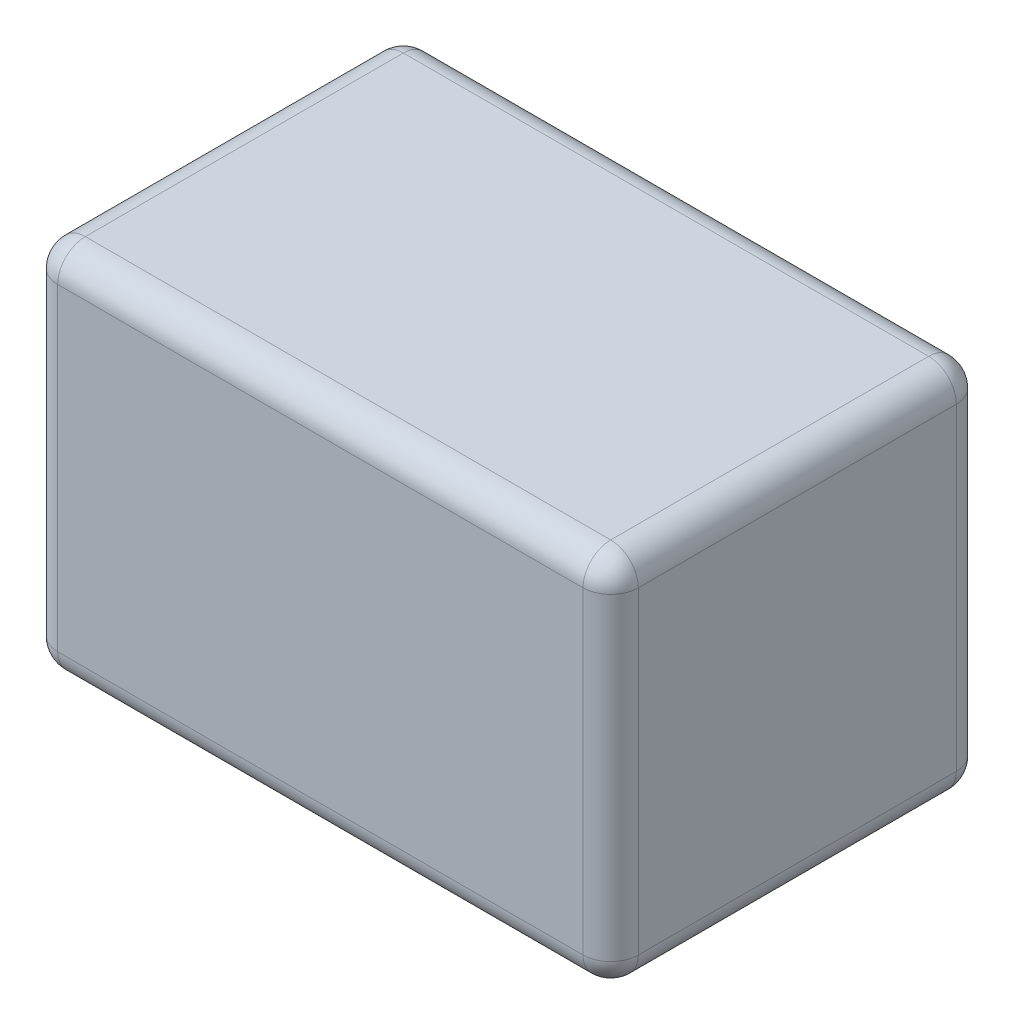
ISO-10303-21;
HEADER;
FILE_DESCRIPTION(('STEP AP214'),'2;1');
FILE_NAME('part.step','',(''),(''),'','','');
FILE_SCHEMA(('AUTOMOTIVE_DESIGN { 1 0 10303 214 1 1 1 1 }'));
ENDSEC;
DATA;
#1=APPLICATION_CONTEXT('core data for automotive mechanical design processes');
#2=APPLICATION_PROTOCOL_DEFINITION('international standard','automotive_design',2000,#1);
#3=PRODUCT_CONTEXT('',#1,'mechanical');
#4=PRODUCT('Part','Part','',(#3));
#5=PRODUCT_RELATED_PRODUCT_CATEGORY('part','',(#4));
#6=PRODUCT_DEFINITION_FORMATION('','',#4);
#7=PRODUCT_DEFINITION_CONTEXT('part definition',#1,'design');
#8=PRODUCT_DEFINITION('design','',#6,#7);
#9=PRODUCT_DEFINITION_SHAPE('','',#8);
#10=(LENGTH_UNIT() NAMED_UNIT(*) SI_UNIT(.MILLI.,.METRE.));
#11=(NAMED_UNIT(*) PLANE_ANGLE_UNIT() SI_UNIT($,.RADIAN.));
#12=(NAMED_UNIT(*) SI_UNIT($,.STERADIAN.) SOLID_ANGLE_UNIT());
#13=UNCERTAINTY_MEASURE_WITH_UNIT(LENGTH_MEASURE(1.E-05),#10,'distance_accuracy_value','');
#14=(GEOMETRIC_REPRESENTATION_CONTEXT(3) GLOBAL_UNCERTAINTY_ASSIGNED_CONTEXT((#13)) GLOBAL_UNIT_ASSIGNED_CONTEXT((#10,
#11,#12)) REPRESENTATION_CONTEXT('',''));
#15=CARTESIAN_POINT('',(0.,0.,0.));
#16=DIRECTION('',(0.,0.,1.));
#17=DIRECTION('',(1.,0.,0.));
#18=AXIS2_PLACEMENT_3D('',#15,#16,#17);
#19=CARTESIAN_POINT('',(-0.95,-0.575,1.25));
#20=DIRECTION('',(-1.,0.,0.));
#21=DIRECTION('',(0.,-1.,0.));
#22=AXIS2_PLACEMENT_3D('',#19,#20,#21);
#23=SPHERICAL_SURFACE('',#22,0.1);
#24=CARTESIAN_POINT('',(-0.95,-0.575,1.25));
#25=DIRECTION('',(0.,0.,-1.));
#26=DIRECTION('',(-1.,0.,0.));
#27=AXIS2_PLACEMENT_3D('',#24,#25,#26);
#28=CIRCLE('',#27,0.1);
#29=CARTESIAN_POINT('',(-0.950000000000001,-0.675,1.25));
#30=VERTEX_POINT('',#29);
#31=CARTESIAN_POINT('',(-1.05,-0.575,1.25));
#32=VERTEX_POINT('',#31);
#33=EDGE_CURVE('E145',#30,#32,#28,.T.);
#34=ORIENTED_EDGE('',*,*,#33,.F.);
#35=CARTESIAN_POINT('',(-0.95,-0.575,1.25));
#36=DIRECTION('',(-1.,0.,0.));
#37=DIRECTION('',(0.,0.,1.));
#38=AXIS2_PLACEMENT_3D('',#35,#36,#37);
#39=CIRCLE('',#38,0.1);
#40=CARTESIAN_POINT('',(-0.95,-0.575,1.35));
#41=VERTEX_POINT('',#40);
#42=EDGE_CURVE('E177',#41,#30,#39,.F.);
#43=ORIENTED_EDGE('',*,*,#42,.F.);
#44=CARTESIAN_POINT('',(-0.95,-0.575,1.25));
#45=DIRECTION('',(0.,-1.,0.));
#46=DIRECTION('',(0.,0.,-1.));
#47=AXIS2_PLACEMENT_3D('',#44,#45,#46);
#48=CIRCLE('',#47,0.1);
#49=EDGE_CURVE('E105',#32,#41,#48,.F.);
#50=ORIENTED_EDGE('',*,*,#49,.F.);
#51=EDGE_LOOP('',(#34,#43,#50));
#52=FACE_BOUND('',#51,.T.);
#53=ADVANCED_FACE('F16',(#52),#23,.T.);
#54=CARTESIAN_POINT('',(-0.95,-0.575,0.1));
#55=DIRECTION('',(0.,-1.,0.));
#56=DIRECTION('',(-1.,0.,0.));
#57=AXIS2_PLACEMENT_3D('',#54,#55,#56);
#58=SPHERICAL_SURFACE('',#57,0.1);
#59=CARTESIAN_POINT('',(-0.95,-0.575,0.1));
#60=DIRECTION('',(0.,0.,-1.));
#61=DIRECTION('',(-1.,0.,0.));
#62=AXIS2_PLACEMENT_3D('',#59,#60,#61);
#63=CIRCLE('',#62,0.1);
#64=CARTESIAN_POINT('',(-1.05,-0.575,0.1));
#65=VERTEX_POINT('',#64);
#66=CARTESIAN_POINT('',(-0.950000000000001,-0.675,0.0999999999999999));
#67=VERTEX_POINT('',#66);
#68=EDGE_CURVE('E174',#65,#67,#63,.F.);
#69=ORIENTED_EDGE('',*,*,#68,.F.);
#70=CARTESIAN_POINT('',(-0.95,-0.575,0.1));
#71=DIRECTION('',(0.,-1.,0.));
#72=DIRECTION('',(0.,0.,-1.));
#73=AXIS2_PLACEMENT_3D('',#70,#71,#72);
#74=CIRCLE('',#73,0.1);
#75=CARTESIAN_POINT('',(-0.95,-0.575,0.));
#76=VERTEX_POINT('',#75);
#77=EDGE_CURVE('E172',#76,#65,#74,.F.);
#78=ORIENTED_EDGE('',*,*,#77,.F.);
#79=CARTESIAN_POINT('',(-0.950000000000001,-0.575,0.0999999999999999));
#80=DIRECTION('',(1.,0.,0.));
#81=DIRECTION('',(0.,0.,-1.));
#82=AXIS2_PLACEMENT_3D('',#79,#80,#81);
#83=CIRCLE('',#82,0.1);
#84=EDGE_CURVE('E139',#67,#76,#83,.T.);
#85=ORIENTED_EDGE('',*,*,#84,.F.);
#86=EDGE_LOOP('',(#69,#78,#85));
#87=FACE_BOUND('',#86,.T.);
#88=ADVANCED_FACE('F164',(#87),#58,.T.);
#89=CARTESIAN_POINT('',(-1.05,-0.675,0.));
#90=DIRECTION('',(-1.,0.,0.));
#91=DIRECTION('',(0.,0.,1.));
#92=AXIS2_PLACEMENT_3D('',#89,#90,#91);
#93=PLANE('',#92);
#94=DIRECTION('',(0.,-1.,0.));
#95=VECTOR('',#94,1.);
#96=CARTESIAN_POINT('',(-1.05,-0.975,0.1));
#97=LINE('',#96,#95);
#98=CARTESIAN_POINT('',(-1.05,0.575,0.1));
#99=VERTEX_POINT('',#98);
#100=EDGE_CURVE('E170',#65,#99,#97,.F.);
#101=ORIENTED_EDGE('',*,*,#100,.F.);
#102=DIRECTION('',(0.,0.,-1.));
#103=VECTOR('',#102,1.);
#104=CARTESIAN_POINT('',(-1.05,-0.575,-0.4));
#105=LINE('',#104,#103);
#106=EDGE_CURVE('E118',#32,#65,#105,.T.);
#107=ORIENTED_EDGE('',*,*,#106,.F.);
#108=DIRECTION('',(0.,-1.,0.));
#109=VECTOR('',#108,1.);
#110=CARTESIAN_POINT('',(-1.05,-0.975,1.25));
#111=LINE('',#110,#109);
#112=CARTESIAN_POINT('',(-1.05,0.575,1.25));
#113=VERTEX_POINT('',#112);
#114=EDGE_CURVE('E20',#113,#32,#111,.T.);
#115=ORIENTED_EDGE('',*,*,#114,.F.);
#116=DIRECTION('',(0.,0.,1.));
#117=VECTOR('',#116,1.);
#118=CARTESIAN_POINT('',(-1.05,0.575,-0.4));
#119=LINE('',#118,#117);
#120=EDGE_CURVE('E115',#99,#113,#119,.T.);
#121=ORIENTED_EDGE('',*,*,#120,.F.);
#122=EDGE_LOOP('',(#101,#107,#115,#121));
#123=FACE_BOUND('',#122,.T.);
#124=ADVANCED_FACE('F114',(#123),#93,.T.);
#125=CARTESIAN_POINT('',(-0.95,0.575,1.25));
#126=DIRECTION('',(0.,1.,0.));
#127=DIRECTION('',(-1.,0.,0.));
#128=AXIS2_PLACEMENT_3D('',#125,#126,#127);
#129=SPHERICAL_SURFACE('',#128,0.1);
#130=CARTESIAN_POINT('',(-0.95,0.575,1.25));
#131=DIRECTION('',(0.,-1.,0.));
#132=DIRECTION('',(0.,0.,-1.));
#133=AXIS2_PLACEMENT_3D('',#130,#131,#132);
#134=CIRCLE('',#133,0.1);
#135=CARTESIAN_POINT('',(-0.95,0.575,1.35));
#136=VERTEX_POINT('',#135);
#137=EDGE_CURVE('E137',#136,#113,#134,.T.);
#138=ORIENTED_EDGE('',*,*,#137,.F.);
#139=CARTESIAN_POINT('',(-0.95,0.575,1.25));
#140=DIRECTION('',(1.,0.,0.));
#141=DIRECTION('',(0.,0.,-1.));
#142=AXIS2_PLACEMENT_3D('',#139,#140,#141);
#143=CIRCLE('',#142,0.1);
#144=CARTESIAN_POINT('',(-0.95,0.675,1.25));
#145=VERTEX_POINT('',#144);
#146=EDGE_CURVE('E131',#145,#136,#143,.T.);
#147=ORIENTED_EDGE('',*,*,#146,.F.);
#148=CARTESIAN_POINT('',(-0.95,0.575,1.25));
#149=DIRECTION('',(0.,0.,1.));
#150=DIRECTION('',(1.,0.,0.));
#151=AXIS2_PLACEMENT_3D('',#148,#149,#150);
#152=CIRCLE('',#151,0.1);
#153=EDGE_CURVE('E127',#113,#145,#152,.F.);
#154=ORIENTED_EDGE('',*,*,#153,.F.);
#155=EDGE_LOOP('',(#138,#147,#154));
#156=FACE_BOUND('',#155,.T.);
#157=ADVANCED_FACE('F136',(#156),#129,.T.);
#158=CARTESIAN_POINT('',(-0.95,0.575,0.1));
#159=DIRECTION('',(-1.,0.,0.));
#160=DIRECTION('',(0.,1.,0.));
#161=AXIS2_PLACEMENT_3D('',#158,#159,#160);
#162=SPHERICAL_SURFACE('',#161,0.1);
#163=CARTESIAN_POINT('',(-0.95,0.575,0.1));
#164=DIRECTION('',(0.,-1.,0.));
#165=DIRECTION('',(0.,0.,-1.));
#166=AXIS2_PLACEMENT_3D('',#163,#164,#165);
#167=CIRCLE('',#166,0.1);
#168=CARTESIAN_POINT('',(-0.95,0.575,0.));
#169=VERTEX_POINT('',#168);
#170=EDGE_CURVE('E171',#99,#169,#167,.T.);
#171=ORIENTED_EDGE('',*,*,#170,.F.);
#172=CARTESIAN_POINT('',(-0.95,0.575,0.1));
#173=DIRECTION('',(0.,0.,1.));
#174=DIRECTION('',(1.,0.,0.));
#175=AXIS2_PLACEMENT_3D('',#172,#173,#174);
#176=CIRCLE('',#175,0.1);
#177=CARTESIAN_POINT('',(-0.95,0.675,0.0999999999999999));
#178=VERTEX_POINT('',#177);
#179=EDGE_CURVE('E130',#178,#99,#176,.T.);
#180=ORIENTED_EDGE('',*,*,#179,.F.);
#181=CARTESIAN_POINT('',(-0.95,0.575,0.0999999999999999));
#182=DIRECTION('',(-1.,0.,0.));
#183=DIRECTION('',(0.,0.,1.));
#184=AXIS2_PLACEMENT_3D('',#181,#182,#183);
#185=CIRCLE('',#184,0.1);
#186=EDGE_CURVE('E185',#169,#178,#185,.F.);
#187=ORIENTED_EDGE('',*,*,#186,.F.);
#188=EDGE_LOOP('',(#171,#180,#187));
#189=FACE_BOUND('',#188,.T.);
#190=ADVANCED_FACE('F155',(#189),#162,.T.);
#191=CARTESIAN_POINT('',(-0.95,-0.975,1.25));
#192=DIRECTION('',(0.,-1.,0.));
#193=DIRECTION('',(0.,0.,-1.));
#194=AXIS2_PLACEMENT_3D('',#191,#192,#193);
#195=CYLINDRICAL_SURFACE('',#194,0.1);
#196=DIRECTION('',(0.,1.,0.));
#197=VECTOR('',#196,1.);
#198=CARTESIAN_POINT('',(-0.95,-0.675,1.35));
#199=LINE('',#198,#197);
#200=EDGE_CURVE('E144',#136,#41,#199,.F.);
#201=ORIENTED_EDGE('',*,*,#200,.F.);
#202=ORIENTED_EDGE('',*,*,#137,.T.);
#203=ORIENTED_EDGE('',*,*,#114,.T.);
#204=ORIENTED_EDGE('',*,*,#49,.T.);
#205=EDGE_LOOP('',(#201,#202,#203,#204));
#206=FACE_BOUND('',#205,.T.);
#207=ADVANCED_FACE('F142',(#206),#195,.T.);
#208=CARTESIAN_POINT('',(-0.95,-0.575,-0.4));
#209=DIRECTION('',(0.,0.,-1.));
#210=DIRECTION('',(-1.,0.,0.));
#211=AXIS2_PLACEMENT_3D('',#208,#209,#210);
#212=CYLINDRICAL_SURFACE('',#211,0.1);
#213=ORIENTED_EDGE('',*,*,#68,.T.);
#214=DIRECTION('',(0.,0.,1.));
#215=VECTOR('',#214,1.);
#216=CARTESIAN_POINT('',(-0.950000000000001,-0.675,0.));
#217=LINE('',#216,#215);
#218=EDGE_CURVE('E184',#67,#30,#217,.T.);
#219=ORIENTED_EDGE('',*,*,#218,.T.);
#220=ORIENTED_EDGE('',*,*,#33,.T.);
#221=ORIENTED_EDGE('',*,*,#106,.T.);
#222=EDGE_LOOP('',(#213,#219,#220,#221));
#223=FACE_BOUND('',#222,.T.);
#224=ADVANCED_FACE('F351',(#223),#212,.T.);
#225=CARTESIAN_POINT('',(-0.95,-0.975,0.1));
#226=DIRECTION('',(0.,-1.,0.));
#227=DIRECTION('',(0.,0.,-1.));
#228=AXIS2_PLACEMENT_3D('',#225,#226,#227);
#229=CYLINDRICAL_SURFACE('',#228,0.1);
#230=ORIENTED_EDGE('',*,*,#100,.T.);
#231=ORIENTED_EDGE('',*,*,#170,.T.);
#232=DIRECTION('',(0.,1.,0.));
#233=VECTOR('',#232,1.);
#234=CARTESIAN_POINT('',(-0.95,-0.675,0.));
#235=LINE('',#234,#233);
#236=EDGE_CURVE('E188',#76,#169,#235,.T.);
#237=ORIENTED_EDGE('',*,*,#236,.F.);
#238=ORIENTED_EDGE('',*,*,#77,.T.);
#239=EDGE_LOOP('',(#230,#231,#237,#238));
#240=FACE_BOUND('',#239,.T.);
#241=ADVANCED_FACE('F214',(#240),#229,.T.);
#242=CARTESIAN_POINT('',(-0.95,0.575,-0.4));
#243=DIRECTION('',(0.,0.,1.));
#244=DIRECTION('',(1.,0.,0.));
#245=AXIS2_PLACEMENT_3D('',#242,#243,#244);
#246=CYLINDRICAL_SURFACE('',#245,0.1);
#247=ORIENTED_EDGE('',*,*,#179,.T.);
#248=ORIENTED_EDGE('',*,*,#120,.T.);
#249=ORIENTED_EDGE('',*,*,#153,.T.);
#250=DIRECTION('',(0.,0.,1.));
#251=VECTOR('',#250,1.);
#252=CARTESIAN_POINT('',(-0.95,0.675,0.));
#253=LINE('',#252,#251);
#254=EDGE_CURVE('E198',#178,#145,#253,.T.);
#255=ORIENTED_EDGE('',*,*,#254,.F.);
#256=EDGE_LOOP('',(#247,#248,#249,#255));
#257=FACE_BOUND('',#256,.T.);
#258=ADVANCED_FACE('F125',(#257),#246,.T.);
#259=CARTESIAN_POINT('',(-1.35,-0.575,1.25));
#260=DIRECTION('',(-1.,0.,0.));
#261=DIRECTION('',(0.,0.,1.));
#262=AXIS2_PLACEMENT_3D('',#259,#260,#261);
#263=CYLINDRICAL_SURFACE('',#262,0.1);
#264=CARTESIAN_POINT('',(0.95,-0.575,1.25));
#265=DIRECTION('',(-1.,0.,0.));
#266=DIRECTION('',(0.,-1.,0.));
#267=AXIS2_PLACEMENT_3D('',#264,#265,#266);
#268=CIRCLE('',#267,0.1);
#269=CARTESIAN_POINT('',(0.95,-0.575,1.35));
#270=VERTEX_POINT('',#269);
#271=CARTESIAN_POINT('',(0.95,-0.675,1.25));
#272=VERTEX_POINT('',#271);
#273=EDGE_CURVE('E247',#270,#272,#268,.F.);
#274=ORIENTED_EDGE('',*,*,#273,.F.);
#275=DIRECTION('',(1.,0.,0.));
#276=VECTOR('',#275,1.);
#277=CARTESIAN_POINT('',(-1.05,-0.575,1.35));
#278=LINE('',#277,#276);
#279=EDGE_CURVE('E253',#41,#270,#278,.T.);
#280=ORIENTED_EDGE('',*,*,#279,.F.);
#281=ORIENTED_EDGE('',*,*,#42,.T.);
#282=DIRECTION('',(1.,0.,0.));
#283=VECTOR('',#282,1.);
#284=CARTESIAN_POINT('',(0.,-0.675,1.25));
#285=LINE('',#284,#283);
#286=EDGE_CURVE('E239',#30,#272,#285,.T.);
#287=ORIENTED_EDGE('',*,*,#286,.T.);
#288=EDGE_LOOP('',(#274,#280,#281,#287));
#289=FACE_BOUND('',#288,.T.);
#290=ADVANCED_FACE('F344',(#289),#263,.T.);
#291=CARTESIAN_POINT('',(1.35,-0.575,0.1));
#292=DIRECTION('',(1.,0.,0.));
#293=DIRECTION('',(0.,0.,-1.));
#294=AXIS2_PLACEMENT_3D('',#291,#292,#293);
#295=CYLINDRICAL_SURFACE('',#294,0.1);
#296=CARTESIAN_POINT('',(0.95,-0.575,0.1));
#297=DIRECTION('',(1.,0.,0.));
#298=DIRECTION('',(0.,-1.,0.));
#299=AXIS2_PLACEMENT_3D('',#296,#297,#298);
#300=CIRCLE('',#299,0.1);
#301=CARTESIAN_POINT('',(0.95,-0.675,0.1));
#302=VERTEX_POINT('',#301);
#303=CARTESIAN_POINT('',(0.95,-0.575,0.));
#304=VERTEX_POINT('',#303);
#305=EDGE_CURVE('E228',#302,#304,#300,.T.);
#306=ORIENTED_EDGE('',*,*,#305,.F.);
#307=DIRECTION('',(1.,0.,0.));
#308=VECTOR('',#307,1.);
#309=CARTESIAN_POINT('',(0.,-0.675,0.1));
#310=LINE('',#309,#308);
#311=EDGE_CURVE('E211',#302,#67,#310,.F.);
#312=ORIENTED_EDGE('',*,*,#311,.T.);
#313=ORIENTED_EDGE('',*,*,#84,.T.);
#314=DIRECTION('',(-1.,0.,0.));
#315=VECTOR('',#314,1.);
#316=CARTESIAN_POINT('',(1.05,-0.575,0.));
#317=LINE('',#316,#315);
#318=EDGE_CURVE('E208',#304,#76,#317,.T.);
#319=ORIENTED_EDGE('',*,*,#318,.F.);
#320=EDGE_LOOP('',(#306,#312,#313,#319));
#321=FACE_BOUND('',#320,.T.);
#322=ADVANCED_FACE('F207',(#321),#295,.T.);
#323=CARTESIAN_POINT('',(-1.35,0.575,1.25));
#324=DIRECTION('',(1.,0.,0.));
#325=DIRECTION('',(0.,0.,-1.));
#326=AXIS2_PLACEMENT_3D('',#323,#324,#325);
#327=CYLINDRICAL_SURFACE('',#326,0.1);
#328=CARTESIAN_POINT('',(0.95,0.575,1.25));
#329=DIRECTION('',(1.,0.,0.));
#330=DIRECTION('',(0.,1.,0.));
#331=AXIS2_PLACEMENT_3D('',#328,#329,#330);
#332=CIRCLE('',#331,0.1);
#333=CARTESIAN_POINT('',(0.95,0.675,1.25));
#334=VERTEX_POINT('',#333);
#335=CARTESIAN_POINT('',(0.95,0.575,1.35));
#336=VERTEX_POINT('',#335);
#337=EDGE_CURVE('E223',#334,#336,#332,.T.);
#338=ORIENTED_EDGE('',*,*,#337,.F.);
#339=DIRECTION('',(1.,0.,0.));
#340=VECTOR('',#339,1.);
#341=CARTESIAN_POINT('',(0.,0.675,1.25));
#342=LINE('',#341,#340);
#343=EDGE_CURVE('E263',#145,#334,#342,.T.);
#344=ORIENTED_EDGE('',*,*,#343,.F.);
#345=ORIENTED_EDGE('',*,*,#146,.T.);
#346=DIRECTION('',(1.,0.,0.));
#347=VECTOR('',#346,1.);
#348=CARTESIAN_POINT('',(-1.05,0.575,1.35));
#349=LINE('',#348,#347);
#350=EDGE_CURVE('E250',#336,#136,#349,.F.);
#351=ORIENTED_EDGE('',*,*,#350,.F.);
#352=EDGE_LOOP('',(#338,#344,#345,#351));
#353=FACE_BOUND('',#352,.T.);
#354=ADVANCED_FACE('F287',(#353),#327,.T.);
#355=CARTESIAN_POINT('',(1.35,0.575,0.1));
#356=DIRECTION('',(-1.,0.,0.));
#357=DIRECTION('',(0.,0.,1.));
#358=AXIS2_PLACEMENT_3D('',#355,#356,#357);
#359=CYLINDRICAL_SURFACE('',#358,0.1);
#360=CARTESIAN_POINT('',(0.95,0.575,0.0999999999999999));
#361=DIRECTION('',(-1.,0.,0.));
#362=DIRECTION('',(0.,1.,0.));
#363=AXIS2_PLACEMENT_3D('',#360,#361,#362);
#364=CIRCLE('',#363,0.1);
#365=CARTESIAN_POINT('',(0.95,0.575,0.));
#366=VERTEX_POINT('',#365);
#367=CARTESIAN_POINT('',(0.95,0.675,0.1));
#368=VERTEX_POINT('',#367);
#369=EDGE_CURVE('E226',#366,#368,#364,.F.);
#370=ORIENTED_EDGE('',*,*,#369,.F.);
#371=DIRECTION('',(-1.,0.,0.));
#372=VECTOR('',#371,1.);
#373=CARTESIAN_POINT('',(1.05,0.575,0.));
#374=LINE('',#373,#372);
#375=EDGE_CURVE('E219',#169,#366,#374,.F.);
#376=ORIENTED_EDGE('',*,*,#375,.F.);
#377=ORIENTED_EDGE('',*,*,#186,.T.);
#378=DIRECTION('',(1.,0.,0.));
#379=VECTOR('',#378,1.);
#380=CARTESIAN_POINT('',(0.,0.675,0.1));
#381=LINE('',#380,#379);
#382=EDGE_CURVE('E265',#368,#178,#381,.F.);
#383=ORIENTED_EDGE('',*,*,#382,.F.);
#384=EDGE_LOOP('',(#370,#376,#377,#383));
#385=FACE_BOUND('',#384,.T.);
#386=ADVANCED_FACE('F337',(#385),#359,.T.);
#387=CARTESIAN_POINT('',(-1.05,-0.675,1.35));
#388=DIRECTION('',(0.,0.,1.));
#389=DIRECTION('',(1.,0.,0.));
#390=AXIS2_PLACEMENT_3D('',#387,#388,#389);
#391=PLANE('',#390);
#392=ORIENTED_EDGE('',*,*,#200,.T.);
#393=ORIENTED_EDGE('',*,*,#279,.T.);
#394=DIRECTION('',(0.,-1.,0.));
#395=VECTOR('',#394,1.);
#396=CARTESIAN_POINT('',(0.95,-0.975,1.35));
#397=LINE('',#396,#395);
#398=EDGE_CURVE('E257',#336,#270,#397,.T.);
#399=ORIENTED_EDGE('',*,*,#398,.F.);
#400=ORIENTED_EDGE('',*,*,#350,.T.);
#401=EDGE_LOOP('',(#392,#393,#399,#400));
#402=FACE_BOUND('',#401,.T.);
#403=ADVANCED_FACE('F285',(#402),#391,.T.);
#404=CARTESIAN_POINT('',(0.95,-0.575,1.25));
#405=DIRECTION('',(0.,-1.,0.));
#406=DIRECTION('',(1.,0.,0.));
#407=AXIS2_PLACEMENT_3D('',#404,#405,#406);
#408=SPHERICAL_SURFACE('',#407,0.1);
#409=ORIENTED_EDGE('',*,*,#273,.T.);
#410=CARTESIAN_POINT('',(0.95,-0.575,1.25));
#411=DIRECTION('',(0.,0.,1.));
#412=DIRECTION('',(1.,0.,0.));
#413=AXIS2_PLACEMENT_3D('',#410,#411,#412);
#414=CIRCLE('',#413,0.1);
#415=CARTESIAN_POINT('',(1.05,-0.575,1.25));
#416=VERTEX_POINT('',#415);
#417=EDGE_CURVE('E245',#416,#272,#414,.F.);
#418=ORIENTED_EDGE('',*,*,#417,.F.);
#419=CARTESIAN_POINT('',(0.95,-0.575,1.25));
#420=DIRECTION('',(0.,-1.,0.));
#421=DIRECTION('',(0.,0.,-1.));
#422=AXIS2_PLACEMENT_3D('',#419,#420,#421);
#423=CIRCLE('',#422,0.1);
#424=EDGE_CURVE('E255',#270,#416,#423,.F.);
#425=ORIENTED_EDGE('',*,*,#424,.F.);
#426=EDGE_LOOP('',(#409,#418,#425));
#427=FACE_BOUND('',#426,.T.);
#428=ADVANCED_FACE('F330',(#427),#408,.T.);
#429=CARTESIAN_POINT('',(0.,-0.675,0.));
#430=DIRECTION('',(0.,1.,0.));
#431=DIRECTION('',(0.,0.,1.));
#432=AXIS2_PLACEMENT_3D('',#429,#430,#431);
#433=PLANE('',#432);
#434=ORIENTED_EDGE('',*,*,#286,.F.);
#435=ORIENTED_EDGE('',*,*,#218,.F.);
#436=ORIENTED_EDGE('',*,*,#311,.F.);
#437=DIRECTION('',(0.,0.,1.));
#438=VECTOR('',#437,1.);
#439=CARTESIAN_POINT('',(0.95,-0.675,1.75));
#440=LINE('',#439,#438);
#441=EDGE_CURVE('E242',#272,#302,#440,.F.);
#442=ORIENTED_EDGE('',*,*,#441,.F.);
#443=EDGE_LOOP('',(#434,#435,#436,#442));
#444=FACE_BOUND('',#443,.T.);
#445=ADVANCED_FACE('F325',(#444),#433,.F.);
#446=CARTESIAN_POINT('',(0.95,-0.575,0.1));
#447=DIRECTION('',(1.,0.,0.));
#448=DIRECTION('',(0.,-1.,0.));
#449=AXIS2_PLACEMENT_3D('',#446,#447,#448);
#450=SPHERICAL_SURFACE('',#449,0.1);
#451=ORIENTED_EDGE('',*,*,#305,.T.);
#452=CARTESIAN_POINT('',(0.95,-0.575,0.1));
#453=DIRECTION('',(0.,-1.,0.));
#454=DIRECTION('',(0.,0.,-1.));
#455=AXIS2_PLACEMENT_3D('',#452,#453,#454);
#456=CIRCLE('',#455,0.1);
#457=CARTESIAN_POINT('',(1.05,-0.575,0.1));
#458=VERTEX_POINT('',#457);
#459=EDGE_CURVE('E235',#458,#304,#456,.F.);
#460=ORIENTED_EDGE('',*,*,#459,.F.);
#461=CARTESIAN_POINT('',(0.95,-0.575,0.1));
#462=DIRECTION('',(0.,0.,1.));
#463=DIRECTION('',(1.,0.,0.));
#464=AXIS2_PLACEMENT_3D('',#461,#462,#463);
#465=CIRCLE('',#464,0.1);
#466=EDGE_CURVE('E237',#302,#458,#465,.T.);
#467=ORIENTED_EDGE('',*,*,#466,.F.);
#468=EDGE_LOOP('',(#451,#460,#467));
#469=FACE_BOUND('',#468,.T.);
#470=ADVANCED_FACE('F322',(#469),#450,.T.);
#471=CARTESIAN_POINT('',(1.05,-0.675,0.));
#472=DIRECTION('',(0.,0.,-1.));
#473=DIRECTION('',(-1.,0.,0.));
#474=AXIS2_PLACEMENT_3D('',#471,#472,#473);
#475=PLANE('',#474);
#476=DIRECTION('',(0.,-1.,0.));
#477=VECTOR('',#476,1.);
#478=CARTESIAN_POINT('',(0.95,-0.975,0.));
#479=LINE('',#478,#477);
#480=EDGE_CURVE('E221',#304,#366,#479,.F.);
#481=ORIENTED_EDGE('',*,*,#480,.F.);
#482=ORIENTED_EDGE('',*,*,#318,.T.);
#483=ORIENTED_EDGE('',*,*,#236,.T.);
#484=ORIENTED_EDGE('',*,*,#375,.T.);
#485=EDGE_LOOP('',(#481,#482,#483,#484));
#486=FACE_BOUND('',#485,.T.);
#487=ADVANCED_FACE('F218',(#486),#475,.T.);
#488=CARTESIAN_POINT('',(0.95,0.575,1.25));
#489=DIRECTION('',(1.,0.,0.));
#490=DIRECTION('',(0.,1.,0.));
#491=AXIS2_PLACEMENT_3D('',#488,#489,#490);
#492=SPHERICAL_SURFACE('',#491,0.1);
#493=ORIENTED_EDGE('',*,*,#337,.T.);
#494=CARTESIAN_POINT('',(0.95,0.575,1.25));
#495=DIRECTION('',(0.,-1.,0.));
#496=DIRECTION('',(0.,0.,-1.));
#497=AXIS2_PLACEMENT_3D('',#494,#495,#496);
#498=CIRCLE('',#497,0.1);
#499=CARTESIAN_POINT('',(1.05,0.575,1.25));
#500=VERTEX_POINT('',#499);
#501=EDGE_CURVE('E232',#500,#336,#498,.T.);
#502=ORIENTED_EDGE('',*,*,#501,.F.);
#503=CARTESIAN_POINT('',(0.95,0.575,1.25));
#504=DIRECTION('',(0.,0.,-1.));
#505=DIRECTION('',(-1.,0.,0.));
#506=AXIS2_PLACEMENT_3D('',#503,#504,#505);
#507=CIRCLE('',#506,0.1);
#508=EDGE_CURVE('E278',#334,#500,#507,.T.);
#509=ORIENTED_EDGE('',*,*,#508,.F.);
#510=EDGE_LOOP('',(#493,#502,#509));
#511=FACE_BOUND('',#510,.T.);
#512=ADVANCED_FACE('F291',(#511),#492,.T.);
#513=CARTESIAN_POINT('',(0.95,0.575,0.1));
#514=DIRECTION('',(0.,1.,0.));
#515=DIRECTION('',(1.,0.,0.));
#516=AXIS2_PLACEMENT_3D('',#513,#514,#515);
#517=SPHERICAL_SURFACE('',#516,0.1);
#518=ORIENTED_EDGE('',*,*,#369,.T.);
#519=CARTESIAN_POINT('',(0.95,0.575,0.1));
#520=DIRECTION('',(0.,0.,-1.));
#521=DIRECTION('',(-1.,0.,0.));
#522=AXIS2_PLACEMENT_3D('',#519,#520,#521);
#523=CIRCLE('',#522,0.1);
#524=CARTESIAN_POINT('',(1.05,0.575,0.1));
#525=VERTEX_POINT('',#524);
#526=EDGE_CURVE('E35',#525,#368,#523,.F.);
#527=ORIENTED_EDGE('',*,*,#526,.F.);
#528=CARTESIAN_POINT('',(0.95,0.575,0.0999999999999999));
#529=DIRECTION('',(0.,-1.,0.));
#530=DIRECTION('',(0.,0.,-1.));
#531=AXIS2_PLACEMENT_3D('',#528,#529,#530);
#532=CIRCLE('',#531,0.1);
#533=EDGE_CURVE('E281',#366,#525,#532,.T.);
#534=ORIENTED_EDGE('',*,*,#533,.F.);
#535=EDGE_LOOP('',(#518,#527,#534));
#536=FACE_BOUND('',#535,.T.);
#537=ADVANCED_FACE('F313',(#536),#517,.T.);
#538=CARTESIAN_POINT('',(0.,0.675,0.));
#539=DIRECTION('',(0.,1.,0.));
#540=DIRECTION('',(0.,0.,1.));
#541=AXIS2_PLACEMENT_3D('',#538,#539,#540);
#542=PLANE('',#541);
#543=ORIENTED_EDGE('',*,*,#254,.T.);
#544=ORIENTED_EDGE('',*,*,#343,.T.);
#545=DIRECTION('',(0.,0.,-1.));
#546=VECTOR('',#545,1.);
#547=CARTESIAN_POINT('',(0.95,0.675,1.75));
#548=LINE('',#547,#546);
#549=EDGE_CURVE('E266',#368,#334,#548,.F.);
#550=ORIENTED_EDGE('',*,*,#549,.F.);
#551=ORIENTED_EDGE('',*,*,#382,.T.);
#552=EDGE_LOOP('',(#543,#544,#550,#551));
#553=FACE_BOUND('',#552,.T.);
#554=ADVANCED_FACE('F261',(#553),#542,.T.);
#555=CARTESIAN_POINT('',(0.95,-0.975,1.25));
#556=DIRECTION('',(0.,-1.,0.));
#557=DIRECTION('',(0.,0.,-1.));
#558=AXIS2_PLACEMENT_3D('',#555,#556,#557);
#559=CYLINDRICAL_SURFACE('',#558,0.1);
#560=DIRECTION('',(0.,1.,0.));
#561=VECTOR('',#560,1.);
#562=CARTESIAN_POINT('',(1.05,-0.675,1.25));
#563=LINE('',#562,#561);
#564=EDGE_CURVE('E277',#500,#416,#563,.F.);
#565=ORIENTED_EDGE('',*,*,#564,.F.);
#566=ORIENTED_EDGE('',*,*,#501,.T.);
#567=ORIENTED_EDGE('',*,*,#398,.T.);
#568=ORIENTED_EDGE('',*,*,#424,.T.);
#569=EDGE_LOOP('',(#565,#566,#567,#568));
#570=FACE_BOUND('',#569,.T.);
#571=ADVANCED_FACE('F369',(#570),#559,.T.);
#572=CARTESIAN_POINT('',(0.95,-0.575,1.75));
#573=DIRECTION('',(0.,0.,1.));
#574=DIRECTION('',(1.,0.,0.));
#575=AXIS2_PLACEMENT_3D('',#572,#573,#574);
#576=CYLINDRICAL_SURFACE('',#575,0.1);
#577=ORIENTED_EDGE('',*,*,#466,.T.);
#578=DIRECTION('',(0.,0.,-1.));
#579=VECTOR('',#578,1.);
#580=CARTESIAN_POINT('',(1.05,-0.575,1.35));
#581=LINE('',#580,#579);
#582=EDGE_CURVE('E303',#416,#458,#581,.T.);
#583=ORIENTED_EDGE('',*,*,#582,.F.);
#584=ORIENTED_EDGE('',*,*,#417,.T.);
#585=ORIENTED_EDGE('',*,*,#441,.T.);
#586=EDGE_LOOP('',(#577,#583,#584,#585));
#587=FACE_BOUND('',#586,.T.);
#588=ADVANCED_FACE('F367',(#587),#576,.T.);
#589=CARTESIAN_POINT('',(0.95,-0.975,0.1));
#590=DIRECTION('',(0.,-1.,0.));
#591=DIRECTION('',(0.,0.,-1.));
#592=AXIS2_PLACEMENT_3D('',#589,#590,#591);
#593=CYLINDRICAL_SURFACE('',#592,0.1);
#594=ORIENTED_EDGE('',*,*,#480,.T.);
#595=ORIENTED_EDGE('',*,*,#533,.T.);
#596=DIRECTION('',(0.,1.,0.));
#597=VECTOR('',#596,1.);
#598=CARTESIAN_POINT('',(1.05,-0.675,0.1));
#599=LINE('',#598,#597);
#600=EDGE_CURVE('E26',#458,#525,#599,.T.);
#601=ORIENTED_EDGE('',*,*,#600,.F.);
#602=ORIENTED_EDGE('',*,*,#459,.T.);
#603=EDGE_LOOP('',(#594,#595,#601,#602));
#604=FACE_BOUND('',#603,.T.);
#605=ADVANCED_FACE('F362',(#604),#593,.T.);
#606=CARTESIAN_POINT('',(0.95,0.575,1.75));
#607=DIRECTION('',(0.,0.,-1.));
#608=DIRECTION('',(-1.,0.,0.));
#609=AXIS2_PLACEMENT_3D('',#606,#607,#608);
#610=CYLINDRICAL_SURFACE('',#609,0.1);
#611=ORIENTED_EDGE('',*,*,#526,.T.);
#612=ORIENTED_EDGE('',*,*,#549,.T.);
#613=ORIENTED_EDGE('',*,*,#508,.T.);
#614=DIRECTION('',(0.,0.,-1.));
#615=VECTOR('',#614,1.);
#616=CARTESIAN_POINT('',(1.05,0.575,1.35));
#617=LINE('',#616,#615);
#618=EDGE_CURVE('E11',#525,#500,#617,.F.);
#619=ORIENTED_EDGE('',*,*,#618,.F.);
#620=EDGE_LOOP('',(#611,#612,#613,#619));
#621=FACE_BOUND('',#620,.T.);
#622=ADVANCED_FACE('F295',(#621),#610,.T.);
#623=CARTESIAN_POINT('',(1.05,-0.675,1.35));
#624=DIRECTION('',(1.,0.,0.));
#625=DIRECTION('',(0.,0.,-1.));
#626=AXIS2_PLACEMENT_3D('',#623,#624,#625);
#627=PLANE('',#626);
#628=ORIENTED_EDGE('',*,*,#600,.T.);
#629=ORIENTED_EDGE('',*,*,#618,.T.);
#630=ORIENTED_EDGE('',*,*,#564,.T.);
#631=ORIENTED_EDGE('',*,*,#582,.T.);
#632=EDGE_LOOP('',(#628,#629,#630,#631));
#633=FACE_BOUND('',#632,.T.);
#634=ADVANCED_FACE('F299',(#633),#627,.T.);
#635=CLOSED_SHELL('',(#53,#88,#124,#157,#190,#207,#224,#241,#258,#290,#322,#354,#386,#403,#428,
#445,#470,#487,#512,#537,#554,#571,#588,#605,#622,#634));
#636=MANIFOLD_SOLID_BREP('B1',#635);
#637=ADVANCED_BREP_SHAPE_REPRESENTATION('',(#18,#636),#14);
#638=SHAPE_DEFINITION_REPRESENTATION(#9,#637);
ENDSEC;
END-ISO-10303-21;
